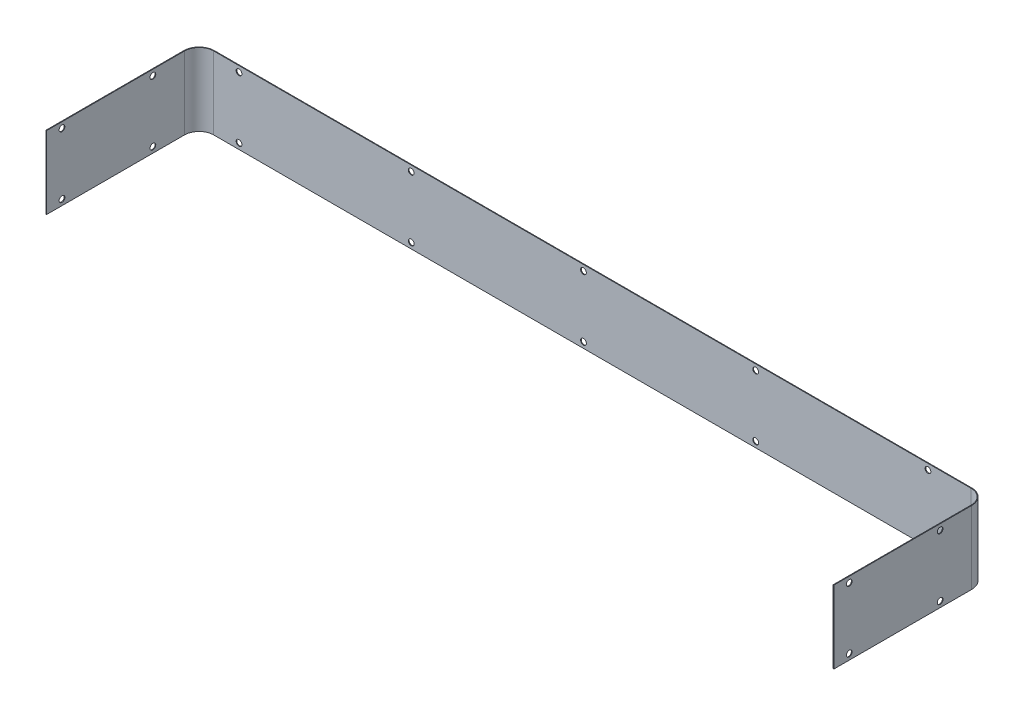
ISO-10303-21;
HEADER;
FILE_DESCRIPTION(('STEP AP214'),'2;1');
FILE_NAME('part.step','',(''),(''),'','','');
FILE_SCHEMA(('AUTOMOTIVE_DESIGN { 1 0 10303 214 1 1 1 1 }'));
ENDSEC;
DATA;
#1=APPLICATION_CONTEXT('core data for automotive mechanical design processes');
#2=APPLICATION_PROTOCOL_DEFINITION('international standard','automotive_design',2000,#1);
#3=PRODUCT_CONTEXT('',#1,'mechanical');
#4=PRODUCT('Part','Part','',(#3));
#5=PRODUCT_RELATED_PRODUCT_CATEGORY('part','',(#4));
#6=PRODUCT_DEFINITION_FORMATION('','',#4);
#7=PRODUCT_DEFINITION_CONTEXT('part definition',#1,'design');
#8=PRODUCT_DEFINITION('design','',#6,#7);
#9=PRODUCT_DEFINITION_SHAPE('','',#8);
#10=(LENGTH_UNIT() NAMED_UNIT(*) SI_UNIT(.MILLI.,.METRE.));
#11=(NAMED_UNIT(*) PLANE_ANGLE_UNIT() SI_UNIT($,.RADIAN.));
#12=(NAMED_UNIT(*) SI_UNIT($,.STERADIAN.) SOLID_ANGLE_UNIT());
#13=UNCERTAINTY_MEASURE_WITH_UNIT(LENGTH_MEASURE(1.E-05),#10,'distance_accuracy_value','');
#14=(GEOMETRIC_REPRESENTATION_CONTEXT(3) GLOBAL_UNCERTAINTY_ASSIGNED_CONTEXT((#13)) GLOBAL_UNIT_ASSIGNED_CONTEXT((#10,
#11,#12)) REPRESENTATION_CONTEXT('',''));
#15=CARTESIAN_POINT('',(0.,0.,0.));
#16=DIRECTION('',(0.,0.,1.));
#17=DIRECTION('',(1.,0.,0.));
#18=AXIS2_PLACEMENT_3D('',#15,#16,#17);
#19=CARTESIAN_POINT('',(16.,76.,-160.));
#20=DIRECTION('',(0.,1.,0.));
#21=DIRECTION('',(0.,0.,1.));
#22=AXIS2_PLACEMENT_3D('',#19,#20,#21);
#23=PLANE('',#22);
#24=DIRECTION('',(0.,0.,1.));
#25=VECTOR('',#24,1.);
#26=CARTESIAN_POINT('',(16.,76.,-160.));
#27=LINE('',#26,#25);
#28=CARTESIAN_POINT('',(16.,76.,-160.));
#29=VERTEX_POINT('',#28);
#30=CARTESIAN_POINT('',(16.,76.,-159.3));
#31=VERTEX_POINT('',#30);
#32=EDGE_CURVE('E11',#29,#31,#27,.T.);
#33=ORIENTED_EDGE('',*,*,#32,.F.);
#34=CARTESIAN_POINT('',(16.,76.,-144.));
#35=DIRECTION('',(0.,-1.,0.));
#36=DIRECTION('',(0.,0.,-1.));
#37=AXIS2_PLACEMENT_3D('',#34,#35,#36);
#38=CIRCLE('',#37,16.);
#39=CARTESIAN_POINT('',(0.,76.,-144.));
#40=VERTEX_POINT('',#39);
#41=EDGE_CURVE('E323',#40,#29,#38,.T.);
#42=ORIENTED_EDGE('',*,*,#41,.F.);
#43=DIRECTION('',(-1.,0.,0.));
#44=VECTOR('',#43,1.);
#45=CARTESIAN_POINT('',(0.70000000000002,76.,-144.));
#46=LINE('',#45,#44);
#47=CARTESIAN_POINT('',(0.70000000000002,76.,-144.));
#48=VERTEX_POINT('',#47);
#49=EDGE_CURVE('E47',#48,#40,#46,.T.);
#50=ORIENTED_EDGE('',*,*,#49,.F.);
#51=CARTESIAN_POINT('',(16.,76.,-144.));
#52=DIRECTION('',(0.,1.,0.));
#53=DIRECTION('',(1.,0.,0.));
#54=AXIS2_PLACEMENT_3D('',#51,#52,#53);
#55=CIRCLE('',#54,15.3);
#56=EDGE_CURVE('E149',#48,#31,#55,.F.);
#57=ORIENTED_EDGE('',*,*,#56,.T.);
#58=EDGE_LOOP('',(#33,#42,#50,#57));
#59=FACE_BOUND('',#58,.T.);
#60=ADVANCED_FACE('F38',(#59),#23,.T.);
#61=CARTESIAN_POINT('',(0.70000000000002,76.,-144.));
#62=DIRECTION('',(0.,1.,0.));
#63=DIRECTION('',(0.,0.,1.));
#64=AXIS2_PLACEMENT_3D('',#61,#62,#63);
#65=PLANE('',#64);
#66=DIRECTION('',(1.,0.,0.));
#67=VECTOR('',#66,1.);
#68=CARTESIAN_POINT('',(16.,76.,-160.));
#69=LINE('',#68,#67);
#70=CARTESIAN_POINT('',(807.4,76.,-160.));
#71=VERTEX_POINT('',#70);
#72=EDGE_CURVE('E143',#29,#71,#69,.T.);
#73=ORIENTED_EDGE('',*,*,#72,.F.);
#74=ORIENTED_EDGE('',*,*,#32,.T.);
#75=DIRECTION('',(1.,0.,0.));
#76=VECTOR('',#75,1.);
#77=CARTESIAN_POINT('',(16.,76.,-159.3));
#78=LINE('',#77,#76);
#79=CARTESIAN_POINT('',(807.4,76.,-159.3));
#80=VERTEX_POINT('',#79);
#81=EDGE_CURVE('E140',#31,#80,#78,.T.);
#82=ORIENTED_EDGE('',*,*,#81,.T.);
#83=DIRECTION('',(0.,0.,-1.));
#84=VECTOR('',#83,1.);
#85=CARTESIAN_POINT('',(807.4,76.,-159.3));
#86=LINE('',#85,#84);
#87=EDGE_CURVE('E232',#80,#71,#86,.T.);
#88=ORIENTED_EDGE('',*,*,#87,.T.);
#89=EDGE_LOOP('',(#73,#74,#82,#88));
#90=FACE_BOUND('',#89,.T.);
#91=ADVANCED_FACE('F138',(#90),#65,.T.);
#92=CARTESIAN_POINT('',(0.,0.,-144.));
#93=DIRECTION('',(0.,-1.,0.));
#94=DIRECTION('',(0.,0.,-1.));
#95=AXIS2_PLACEMENT_3D('',#92,#93,#94);
#96=PLANE('',#95);
#97=DIRECTION('',(1.,0.,0.));
#98=VECTOR('',#97,1.);
#99=CARTESIAN_POINT('',(0.,0.,-144.));
#100=LINE('',#99,#98);
#101=CARTESIAN_POINT('',(0.,0.,-144.));
#102=VERTEX_POINT('',#101);
#103=CARTESIAN_POINT('',(0.70000000000002,0.,-144.));
#104=VERTEX_POINT('',#103);
#105=EDGE_CURVE('E237',#102,#104,#100,.T.);
#106=ORIENTED_EDGE('',*,*,#105,.F.);
#107=CARTESIAN_POINT('',(16.,0.,-144.));
#108=DIRECTION('',(0.,-1.,0.));
#109=DIRECTION('',(0.,0.,-1.));
#110=AXIS2_PLACEMENT_3D('',#107,#108,#109);
#111=CIRCLE('',#110,16.);
#112=CARTESIAN_POINT('',(16.,0.,-160.));
#113=VERTEX_POINT('',#112);
#114=EDGE_CURVE('E189',#102,#113,#111,.T.);
#115=ORIENTED_EDGE('',*,*,#114,.T.);
#116=DIRECTION('',(0.,0.,-1.));
#117=VECTOR('',#116,1.);
#118=CARTESIAN_POINT('',(16.,0.,-159.3));
#119=LINE('',#118,#117);
#120=CARTESIAN_POINT('',(16.,0.,-159.3));
#121=VERTEX_POINT('',#120);
#122=EDGE_CURVE('E235',#121,#113,#119,.T.);
#123=ORIENTED_EDGE('',*,*,#122,.F.);
#124=CARTESIAN_POINT('',(16.,0.,-144.));
#125=DIRECTION('',(0.,1.,0.));
#126=DIRECTION('',(1.,0.,0.));
#127=AXIS2_PLACEMENT_3D('',#124,#125,#126);
#128=CIRCLE('',#127,15.3);
#129=EDGE_CURVE('E161',#104,#121,#128,.F.);
#130=ORIENTED_EDGE('',*,*,#129,.F.);
#131=EDGE_LOOP('',(#106,#115,#123,#130));
#132=FACE_BOUND('',#131,.T.);
#133=ADVANCED_FACE('F341',(#132),#96,.T.);
#134=CARTESIAN_POINT('',(16.,0.,-159.3));
#135=DIRECTION('',(0.,-1.,0.));
#136=DIRECTION('',(0.,0.,-1.));
#137=AXIS2_PLACEMENT_3D('',#134,#135,#136);
#138=PLANE('',#137);
#139=DIRECTION('',(0.,0.,-1.));
#140=VECTOR('',#139,1.);
#141=CARTESIAN_POINT('',(0.,0.,0.));
#142=LINE('',#141,#140);
#143=CARTESIAN_POINT('',(0.,0.,0.));
#144=VERTEX_POINT('',#143);
#145=EDGE_CURVE('E192',#144,#102,#142,.T.);
#146=ORIENTED_EDGE('',*,*,#145,.T.);
#147=ORIENTED_EDGE('',*,*,#105,.T.);
#148=DIRECTION('',(0.,0.,-1.));
#149=VECTOR('',#148,1.);
#150=CARTESIAN_POINT('',(0.7,0.,0.));
#151=LINE('',#150,#149);
#152=CARTESIAN_POINT('',(0.7,0.,0.));
#153=VERTEX_POINT('',#152);
#154=EDGE_CURVE('E198',#153,#104,#151,.T.);
#155=ORIENTED_EDGE('',*,*,#154,.F.);
#156=DIRECTION('',(-1.,0.,0.));
#157=VECTOR('',#156,1.);
#158=CARTESIAN_POINT('',(0.7,0.,0.));
#159=LINE('',#158,#157);
#160=EDGE_CURVE('E195',#153,#144,#159,.T.);
#161=ORIENTED_EDGE('',*,*,#160,.T.);
#162=EDGE_LOOP('',(#146,#147,#155,#161));
#163=FACE_BOUND('',#162,.T.);
#164=ADVANCED_FACE('F388',(#163),#138,.T.);
#165=CARTESIAN_POINT('',(823.4,76.,-144.));
#166=DIRECTION('',(0.,1.,0.));
#167=DIRECTION('',(0.,0.,1.));
#168=AXIS2_PLACEMENT_3D('',#165,#166,#167);
#169=PLANE('',#168);
#170=DIRECTION('',(-1.,0.,0.));
#171=VECTOR('',#170,1.);
#172=CARTESIAN_POINT('',(823.4,76.,-144.));
#173=LINE('',#172,#171);
#174=CARTESIAN_POINT('',(823.4,76.,-144.));
#175=VERTEX_POINT('',#174);
#176=CARTESIAN_POINT('',(822.7,76.,-144.));
#177=VERTEX_POINT('',#176);
#178=EDGE_CURVE('E56',#175,#177,#173,.T.);
#179=ORIENTED_EDGE('',*,*,#178,.F.);
#180=CARTESIAN_POINT('',(807.4,76.,-144.));
#181=DIRECTION('',(0.,-1.,0.));
#182=DIRECTION('',(0.,0.,-1.));
#183=AXIS2_PLACEMENT_3D('',#180,#181,#182);
#184=CIRCLE('',#183,16.);
#185=EDGE_CURVE('E319',#71,#175,#184,.T.);
#186=ORIENTED_EDGE('',*,*,#185,.F.);
#187=ORIENTED_EDGE('',*,*,#87,.F.);
#188=CARTESIAN_POINT('',(807.4,76.,-144.));
#189=DIRECTION('',(0.,1.,0.));
#190=DIRECTION('',(1.,0.,0.));
#191=AXIS2_PLACEMENT_3D('',#188,#189,#190);
#192=CIRCLE('',#191,15.3);
#193=EDGE_CURVE('E169',#80,#177,#192,.F.);
#194=ORIENTED_EDGE('',*,*,#193,.T.);
#195=EDGE_LOOP('',(#179,#186,#187,#194));
#196=FACE_BOUND('',#195,.T.);
#197=ADVANCED_FACE('F393',(#196),#169,.T.);
#198=CARTESIAN_POINT('',(807.4,76.,-159.3));
#199=DIRECTION('',(0.,1.,0.));
#200=DIRECTION('',(0.,0.,1.));
#201=AXIS2_PLACEMENT_3D('',#198,#199,#200);
#202=PLANE('',#201);
#203=DIRECTION('',(0.,0.,1.));
#204=VECTOR('',#203,1.);
#205=CARTESIAN_POINT('',(823.4,76.,-144.));
#206=LINE('',#205,#204);
#207=CARTESIAN_POINT('',(823.4,76.,0.));
#208=VERTEX_POINT('',#207);
#209=EDGE_CURVE('E316',#175,#208,#206,.T.);
#210=ORIENTED_EDGE('',*,*,#209,.F.);
#211=ORIENTED_EDGE('',*,*,#178,.T.);
#212=DIRECTION('',(0.,0.,-1.));
#213=VECTOR('',#212,1.);
#214=CARTESIAN_POINT('',(822.7,76.,-144.));
#215=LINE('',#214,#213);
#216=CARTESIAN_POINT('',(822.7,76.,0.));
#217=VERTEX_POINT('',#216);
#218=EDGE_CURVE('E110',#177,#217,#215,.F.);
#219=ORIENTED_EDGE('',*,*,#218,.T.);
#220=DIRECTION('',(-1.,0.,0.));
#221=VECTOR('',#220,1.);
#222=CARTESIAN_POINT('',(823.4,76.,0.));
#223=LINE('',#222,#221);
#224=EDGE_CURVE('E313',#208,#217,#223,.T.);
#225=ORIENTED_EDGE('',*,*,#224,.F.);
#226=EDGE_LOOP('',(#210,#211,#219,#225));
#227=FACE_BOUND('',#226,.T.);
#228=ADVANCED_FACE('F368',(#227),#202,.T.);
#229=CARTESIAN_POINT('',(807.4,0.,-160.));
#230=DIRECTION('',(0.,-1.,0.));
#231=DIRECTION('',(0.,0.,-1.));
#232=AXIS2_PLACEMENT_3D('',#229,#230,#231);
#233=PLANE('',#232);
#234=DIRECTION('',(0.,0.,1.));
#235=VECTOR('',#234,1.);
#236=CARTESIAN_POINT('',(807.4,0.,-160.));
#237=LINE('',#236,#235);
#238=CARTESIAN_POINT('',(807.4,0.,-160.));
#239=VERTEX_POINT('',#238);
#240=CARTESIAN_POINT('',(807.4,0.,-159.3));
#241=VERTEX_POINT('',#240);
#242=EDGE_CURVE('E97',#239,#241,#237,.T.);
#243=ORIENTED_EDGE('',*,*,#242,.F.);
#244=CARTESIAN_POINT('',(807.4,0.,-144.));
#245=DIRECTION('',(0.,-1.,0.));
#246=DIRECTION('',(0.,0.,-1.));
#247=AXIS2_PLACEMENT_3D('',#244,#245,#246);
#248=CIRCLE('',#247,16.);
#249=CARTESIAN_POINT('',(823.4,0.,-144.));
#250=VERTEX_POINT('',#249);
#251=EDGE_CURVE('E185',#239,#250,#248,.T.);
#252=ORIENTED_EDGE('',*,*,#251,.T.);
#253=DIRECTION('',(1.,0.,0.));
#254=VECTOR('',#253,1.);
#255=CARTESIAN_POINT('',(822.7,0.,-144.));
#256=LINE('',#255,#254);
#257=CARTESIAN_POINT('',(822.7,0.,-144.));
#258=VERTEX_POINT('',#257);
#259=EDGE_CURVE('E104',#258,#250,#256,.T.);
#260=ORIENTED_EDGE('',*,*,#259,.F.);
#261=CARTESIAN_POINT('',(807.4,0.,-144.));
#262=DIRECTION('',(0.,1.,0.));
#263=DIRECTION('',(1.,0.,0.));
#264=AXIS2_PLACEMENT_3D('',#261,#262,#263);
#265=CIRCLE('',#264,15.3);
#266=EDGE_CURVE('E204',#241,#258,#265,.F.);
#267=ORIENTED_EDGE('',*,*,#266,.F.);
#268=EDGE_LOOP('',(#243,#252,#260,#267));
#269=FACE_BOUND('',#268,.T.);
#270=ADVANCED_FACE('F356',(#269),#233,.T.);
#271=CARTESIAN_POINT('',(822.7,0.,-144.));
#272=DIRECTION('',(0.,-1.,0.));
#273=DIRECTION('',(0.,0.,-1.));
#274=AXIS2_PLACEMENT_3D('',#271,#272,#273);
#275=PLANE('',#274);
#276=DIRECTION('',(1.,0.,0.));
#277=VECTOR('',#276,1.);
#278=CARTESIAN_POINT('',(16.,0.,-160.));
#279=LINE('',#278,#277);
#280=EDGE_CURVE('E187',#113,#239,#279,.T.);
#281=ORIENTED_EDGE('',*,*,#280,.T.);
#282=ORIENTED_EDGE('',*,*,#242,.T.);
#283=DIRECTION('',(1.,0.,0.));
#284=VECTOR('',#283,1.);
#285=CARTESIAN_POINT('',(16.,0.,-159.3));
#286=LINE('',#285,#284);
#287=EDGE_CURVE('E202',#121,#241,#286,.T.);
#288=ORIENTED_EDGE('',*,*,#287,.F.);
#289=ORIENTED_EDGE('',*,*,#122,.T.);
#290=EDGE_LOOP('',(#281,#282,#288,#289));
#291=FACE_BOUND('',#290,.T.);
#292=ADVANCED_FACE('F343',(#291),#275,.T.);
#293=CARTESIAN_POINT('',(822.7,76.,-144.));
#294=DIRECTION('',(1.,0.,0.));
#295=DIRECTION('',(0.,0.,-1.));
#296=AXIS2_PLACEMENT_3D('',#293,#294,#295);
#297=PLANE('',#296);
#298=CARTESIAN_POINT('',(822.7,6.00000000000003,-16.));
#299=DIRECTION('',(1.,0.,0.));
#300=DIRECTION('',(0.,0.,-1.));
#301=AXIS2_PLACEMENT_3D('',#298,#299,#300);
#302=CIRCLE('',#301,3.);
#303=CARTESIAN_POINT('',(822.7,6.00000000000003,-19.));
#304=VERTEX_POINT('',#303);
#305=EDGE_CURVE('E179',#304,#304,#302,.T.);
#306=ORIENTED_EDGE('',*,*,#305,.T.);
#307=EDGE_LOOP('',(#306));
#308=FACE_BOUND('',#307,.T.);
#309=CARTESIAN_POINT('',(822.7,6.00000000000001,-111.));
#310=DIRECTION('',(1.,0.,0.));
#311=DIRECTION('',(0.,0.,-1.));
#312=AXIS2_PLACEMENT_3D('',#309,#310,#311);
#313=CIRCLE('',#312,3.00000000000001);
#314=CARTESIAN_POINT('',(822.7,6.00000000000001,-114.));
#315=VERTEX_POINT('',#314);
#316=EDGE_CURVE('E252',#315,#315,#313,.T.);
#317=ORIENTED_EDGE('',*,*,#316,.T.);
#318=EDGE_LOOP('',(#317));
#319=FACE_BOUND('',#318,.T.);
#320=CARTESIAN_POINT('',(822.7,70.,-111.));
#321=DIRECTION('',(1.,0.,0.));
#322=DIRECTION('',(0.,0.,-1.));
#323=AXIS2_PLACEMENT_3D('',#320,#321,#322);
#324=CIRCLE('',#323,3.00000000000001);
#325=CARTESIAN_POINT('',(822.7,70.,-114.));
#326=VERTEX_POINT('',#325);
#327=EDGE_CURVE('E248',#326,#326,#324,.T.);
#328=ORIENTED_EDGE('',*,*,#327,.T.);
#329=EDGE_LOOP('',(#328));
#330=FACE_BOUND('',#329,.T.);
#331=CARTESIAN_POINT('',(822.7,70.,-16.));
#332=DIRECTION('',(1.,0.,0.));
#333=DIRECTION('',(0.,0.,-1.));
#334=AXIS2_PLACEMENT_3D('',#331,#332,#333);
#335=CIRCLE('',#334,3.);
#336=CARTESIAN_POINT('',(822.7,70.,-19.));
#337=VERTEX_POINT('',#336);
#338=EDGE_CURVE('E243',#337,#337,#335,.T.);
#339=ORIENTED_EDGE('',*,*,#338,.T.);
#340=EDGE_LOOP('',(#339));
#341=FACE_BOUND('',#340,.T.);
#342=DIRECTION('',(0.,0.,-1.));
#343=VECTOR('',#342,1.);
#344=CARTESIAN_POINT('',(822.7,0.,-144.));
#345=LINE('',#344,#343);
#346=CARTESIAN_POINT('',(822.7,0.,0.));
#347=VERTEX_POINT('',#346);
#348=EDGE_CURVE('E175',#258,#347,#345,.F.);
#349=ORIENTED_EDGE('',*,*,#348,.T.);
#350=DIRECTION('',(0.,-1.,0.));
#351=VECTOR('',#350,1.);
#352=CARTESIAN_POINT('',(822.7,76.,0.));
#353=LINE('',#352,#351);
#354=EDGE_CURVE('E228',#217,#347,#353,.T.);
#355=ORIENTED_EDGE('',*,*,#354,.F.);
#356=ORIENTED_EDGE('',*,*,#218,.F.);
#357=DIRECTION('',(0.,-1.,0.));
#358=VECTOR('',#357,1.);
#359=CARTESIAN_POINT('',(822.7,76.,-144.));
#360=LINE('',#359,#358);
#361=EDGE_CURVE('E171',#177,#258,#360,.T.);
#362=ORIENTED_EDGE('',*,*,#361,.T.);
#363=EDGE_LOOP('',(#349,#355,#356,#362));
#364=FACE_BOUND('',#363,.T.);
#365=ADVANCED_FACE('F362',(#308,#319,#330,#341,#364),#297,.F.);
#366=CARTESIAN_POINT('',(823.4,76.,0.));
#367=DIRECTION('',(0.,0.,1.));
#368=DIRECTION('',(1.,0.,0.));
#369=AXIS2_PLACEMENT_3D('',#366,#367,#368);
#370=PLANE('',#369);
#371=DIRECTION('',(-1.,0.,0.));
#372=VECTOR('',#371,1.);
#373=CARTESIAN_POINT('',(823.4,0.,0.));
#374=LINE('',#373,#372);
#375=CARTESIAN_POINT('',(823.4,0.,0.));
#376=VERTEX_POINT('',#375);
#377=EDGE_CURVE('E178',#376,#347,#374,.T.);
#378=ORIENTED_EDGE('',*,*,#377,.F.);
#379=DIRECTION('',(0.,-1.,0.));
#380=VECTOR('',#379,1.);
#381=CARTESIAN_POINT('',(823.4,76.,0.));
#382=LINE('',#381,#380);
#383=EDGE_CURVE('E226',#208,#376,#382,.T.);
#384=ORIENTED_EDGE('',*,*,#383,.F.);
#385=ORIENTED_EDGE('',*,*,#224,.T.);
#386=ORIENTED_EDGE('',*,*,#354,.T.);
#387=EDGE_LOOP('',(#378,#384,#385,#386));
#388=FACE_BOUND('',#387,.T.);
#389=ADVANCED_FACE('F367',(#388),#370,.T.);
#390=CARTESIAN_POINT('',(823.4,76.,-144.));
#391=DIRECTION('',(1.,0.,0.));
#392=DIRECTION('',(0.,0.,-1.));
#393=AXIS2_PLACEMENT_3D('',#390,#391,#392);
#394=PLANE('',#393);
#395=CARTESIAN_POINT('',(823.4,6.00000000000003,-16.));
#396=DIRECTION('',(1.,0.,0.));
#397=DIRECTION('',(0.,0.,1.));
#398=AXIS2_PLACEMENT_3D('',#395,#396,#397);
#399=CIRCLE('',#398,3.);
#400=CARTESIAN_POINT('',(823.4,6.00000000000003,-13.));
#401=VERTEX_POINT('',#400);
#402=EDGE_CURVE('E285',#401,#401,#399,.T.);
#403=ORIENTED_EDGE('',*,*,#402,.F.);
#404=EDGE_LOOP('',(#403));
#405=FACE_BOUND('',#404,.T.);
#406=CARTESIAN_POINT('',(823.4,6.00000000000001,-111.));
#407=DIRECTION('',(1.,0.,0.));
#408=DIRECTION('',(0.,0.,1.));
#409=AXIS2_PLACEMENT_3D('',#406,#407,#408);
#410=CIRCLE('',#409,3.00000000000001);
#411=CARTESIAN_POINT('',(823.4,6.00000000000001,-108.));
#412=VERTEX_POINT('',#411);
#413=EDGE_CURVE('E294',#412,#412,#410,.T.);
#414=ORIENTED_EDGE('',*,*,#413,.F.);
#415=EDGE_LOOP('',(#414));
#416=FACE_BOUND('',#415,.T.);
#417=CARTESIAN_POINT('',(823.4,70.,-111.));
#418=DIRECTION('',(1.,0.,0.));
#419=DIRECTION('',(0.,0.,-1.));
#420=AXIS2_PLACEMENT_3D('',#417,#418,#419);
#421=CIRCLE('',#420,3.00000000000001);
#422=CARTESIAN_POINT('',(823.4,70.,-114.));
#423=VERTEX_POINT('',#422);
#424=EDGE_CURVE('E517',#423,#423,#421,.T.);
#425=ORIENTED_EDGE('',*,*,#424,.F.);
#426=EDGE_LOOP('',(#425));
#427=FACE_BOUND('',#426,.T.);
#428=CARTESIAN_POINT('',(823.4,70.,-16.));
#429=DIRECTION('',(1.,0.,0.));
#430=DIRECTION('',(0.,0.,-1.));
#431=AXIS2_PLACEMENT_3D('',#428,#429,#430);
#432=CIRCLE('',#431,3.);
#433=CARTESIAN_POINT('',(823.4,70.,-19.));
#434=VERTEX_POINT('',#433);
#435=EDGE_CURVE('E300',#434,#434,#432,.T.);
#436=ORIENTED_EDGE('',*,*,#435,.F.);
#437=EDGE_LOOP('',(#436));
#438=FACE_BOUND('',#437,.T.);
#439=DIRECTION('',(0.,0.,1.));
#440=VECTOR('',#439,1.);
#441=CARTESIAN_POINT('',(823.4,0.,-144.));
#442=LINE('',#441,#440);
#443=EDGE_CURVE('E182',#250,#376,#442,.T.);
#444=ORIENTED_EDGE('',*,*,#443,.F.);
#445=DIRECTION('',(0.,-1.,0.));
#446=VECTOR('',#445,1.);
#447=CARTESIAN_POINT('',(823.4,76.,-144.));
#448=LINE('',#447,#446);
#449=EDGE_CURVE('E223',#175,#250,#448,.T.);
#450=ORIENTED_EDGE('',*,*,#449,.F.);
#451=ORIENTED_EDGE('',*,*,#209,.T.);
#452=ORIENTED_EDGE('',*,*,#383,.T.);
#453=EDGE_LOOP('',(#444,#450,#451,#452));
#454=FACE_BOUND('',#453,.T.);
#455=ADVANCED_FACE('F370',(#405,#416,#427,#438,#454),#394,.T.);
#456=CARTESIAN_POINT('',(807.4,76.,-144.));
#457=DIRECTION('',(0.,-1.,0.));
#458=DIRECTION('',(0.,0.,-1.));
#459=AXIS2_PLACEMENT_3D('',#456,#457,#458);
#460=CYLINDRICAL_SURFACE('',#459,16.);
#461=ORIENTED_EDGE('',*,*,#251,.F.);
#462=DIRECTION('',(0.,-1.,0.));
#463=VECTOR('',#462,1.);
#464=CARTESIAN_POINT('',(807.4,76.,-160.));
#465=LINE('',#464,#463);
#466=EDGE_CURVE('E220',#71,#239,#465,.T.);
#467=ORIENTED_EDGE('',*,*,#466,.F.);
#468=ORIENTED_EDGE('',*,*,#185,.T.);
#469=ORIENTED_EDGE('',*,*,#449,.T.);
#470=EDGE_LOOP('',(#461,#467,#468,#469));
#471=FACE_BOUND('',#470,.T.);
#472=ADVANCED_FACE('F353',(#471),#460,.T.);
#473=CARTESIAN_POINT('',(16.,76.,-160.));
#474=DIRECTION('',(0.,0.,-1.));
#475=DIRECTION('',(-1.,0.,0.));
#476=AXIS2_PLACEMENT_3D('',#473,#474,#475);
#477=PLANE('',#476);
#478=CARTESIAN_POINT('',(42.4000000000007,70.,-160.));
#479=DIRECTION('',(0.,0.,-1.));
#480=DIRECTION('',(-1.,0.,0.));
#481=AXIS2_PLACEMENT_3D('',#478,#479,#480);
#482=CIRCLE('',#481,2.99999999999994);
#483=CARTESIAN_POINT('',(39.4000000000007,70.,-160.));
#484=VERTEX_POINT('',#483);
#485=EDGE_CURVE('E475',#484,#484,#482,.T.);
#486=ORIENTED_EDGE('',*,*,#485,.F.);
#487=EDGE_LOOP('',(#486));
#488=FACE_BOUND('',#487,.T.);
#489=CARTESIAN_POINT('',(582.4,70.,-160.));
#490=DIRECTION('',(0.,0.,-1.));
#491=DIRECTION('',(-1.,0.,0.));
#492=AXIS2_PLACEMENT_3D('',#489,#490,#491);
#493=CIRCLE('',#492,2.99999999999993);
#494=CARTESIAN_POINT('',(579.4,70.,-160.));
#495=VERTEX_POINT('',#494);
#496=EDGE_CURVE('E479',#495,#495,#493,.T.);
#497=ORIENTED_EDGE('',*,*,#496,.F.);
#498=EDGE_LOOP('',(#497));
#499=FACE_BOUND('',#498,.T.);
#500=CARTESIAN_POINT('',(402.4,70.,-160.));
#501=DIRECTION('',(0.,0.,-1.));
#502=DIRECTION('',(-1.,0.,0.));
#503=AXIS2_PLACEMENT_3D('',#500,#501,#502);
#504=CIRCLE('',#503,2.99999999999994);
#505=CARTESIAN_POINT('',(399.4,70.,-160.));
#506=VERTEX_POINT('',#505);
#507=EDGE_CURVE('E483',#506,#506,#504,.T.);
#508=ORIENTED_EDGE('',*,*,#507,.F.);
#509=EDGE_LOOP('',(#508));
#510=FACE_BOUND('',#509,.T.);
#511=CARTESIAN_POINT('',(222.4,70.,-160.));
#512=DIRECTION('',(0.,0.,-1.));
#513=DIRECTION('',(-1.,0.,0.));
#514=AXIS2_PLACEMENT_3D('',#511,#512,#513);
#515=CIRCLE('',#514,2.99999999999994);
#516=CARTESIAN_POINT('',(219.400000000001,70.,-160.));
#517=VERTEX_POINT('',#516);
#518=EDGE_CURVE('E487',#517,#517,#515,.T.);
#519=ORIENTED_EDGE('',*,*,#518,.F.);
#520=EDGE_LOOP('',(#519));
#521=FACE_BOUND('',#520,.T.);
#522=CARTESIAN_POINT('',(42.4000000000007,6.00000000000028,-160.));
#523=DIRECTION('',(0.,0.,-1.));
#524=DIRECTION('',(1.,0.,0.));
#525=AXIS2_PLACEMENT_3D('',#522,#523,#524);
#526=CIRCLE('',#525,2.99999999999994);
#527=CARTESIAN_POINT('',(45.4000000000006,6.00000000000028,-160.));
#528=VERTEX_POINT('',#527);
#529=EDGE_CURVE('E491',#528,#528,#526,.T.);
#530=ORIENTED_EDGE('',*,*,#529,.F.);
#531=EDGE_LOOP('',(#530));
#532=FACE_BOUND('',#531,.T.);
#533=CARTESIAN_POINT('',(222.4,6.00000000000023,-160.));
#534=DIRECTION('',(0.,0.,-1.));
#535=DIRECTION('',(1.,0.,0.));
#536=AXIS2_PLACEMENT_3D('',#533,#534,#535);
#537=CIRCLE('',#536,2.99999999999994);
#538=CARTESIAN_POINT('',(225.4,6.00000000000023,-160.));
#539=VERTEX_POINT('',#538);
#540=EDGE_CURVE('E495',#539,#539,#537,.T.);
#541=ORIENTED_EDGE('',*,*,#540,.F.);
#542=EDGE_LOOP('',(#541));
#543=FACE_BOUND('',#542,.T.);
#544=CARTESIAN_POINT('',(402.4,6.00000000000016,-160.));
#545=DIRECTION('',(0.,0.,-1.));
#546=DIRECTION('',(1.,0.,0.));
#547=AXIS2_PLACEMENT_3D('',#544,#545,#546);
#548=CIRCLE('',#547,2.99999999999994);
#549=CARTESIAN_POINT('',(405.4,6.00000000000016,-160.));
#550=VERTEX_POINT('',#549);
#551=EDGE_CURVE('E499',#550,#550,#548,.T.);
#552=ORIENTED_EDGE('',*,*,#551,.F.);
#553=EDGE_LOOP('',(#552));
#554=FACE_BOUND('',#553,.T.);
#555=CARTESIAN_POINT('',(582.4,6.00000000000009,-160.));
#556=DIRECTION('',(0.,0.,-1.));
#557=DIRECTION('',(1.,0.,0.));
#558=AXIS2_PLACEMENT_3D('',#555,#556,#557);
#559=CIRCLE('',#558,2.99999999999993);
#560=CARTESIAN_POINT('',(585.4,6.00000000000009,-160.));
#561=VERTEX_POINT('',#560);
#562=EDGE_CURVE('E503',#561,#561,#559,.T.);
#563=ORIENTED_EDGE('',*,*,#562,.F.);
#564=EDGE_LOOP('',(#563));
#565=FACE_BOUND('',#564,.T.);
#566=CARTESIAN_POINT('',(762.4,6.00000000000002,-160.));
#567=DIRECTION('',(0.,0.,-1.));
#568=DIRECTION('',(1.,0.,0.));
#569=AXIS2_PLACEMENT_3D('',#566,#567,#568);
#570=CIRCLE('',#569,2.99999999999993);
#571=CARTESIAN_POINT('',(765.4,6.00000000000002,-160.));
#572=VERTEX_POINT('',#571);
#573=EDGE_CURVE('E507',#572,#572,#570,.T.);
#574=ORIENTED_EDGE('',*,*,#573,.F.);
#575=EDGE_LOOP('',(#574));
#576=FACE_BOUND('',#575,.T.);
#577=CARTESIAN_POINT('',(762.4,70.,-160.));
#578=DIRECTION('',(0.,0.,-1.));
#579=DIRECTION('',(-1.,0.,0.));
#580=AXIS2_PLACEMENT_3D('',#577,#578,#579);
#581=CIRCLE('',#580,2.99999999999993);
#582=CARTESIAN_POINT('',(759.4,70.,-160.));
#583=VERTEX_POINT('',#582);
#584=EDGE_CURVE('E260',#583,#583,#581,.T.);
#585=ORIENTED_EDGE('',*,*,#584,.F.);
#586=EDGE_LOOP('',(#585));
#587=FACE_BOUND('',#586,.T.);
#588=ORIENTED_EDGE('',*,*,#280,.F.);
#589=DIRECTION('',(0.,-1.,0.));
#590=VECTOR('',#589,1.);
#591=CARTESIAN_POINT('',(16.,76.,-160.));
#592=LINE('',#591,#590);
#593=EDGE_CURVE('E217',#29,#113,#592,.T.);
#594=ORIENTED_EDGE('',*,*,#593,.F.);
#595=ORIENTED_EDGE('',*,*,#72,.T.);
#596=ORIENTED_EDGE('',*,*,#466,.T.);
#597=EDGE_LOOP('',(#588,#594,#595,#596));
#598=FACE_BOUND('',#597,.T.);
#599=ADVANCED_FACE('F348',(#488,#499,#510,#521,#532,#543,#554,#565,#576,#587,#598),#477,.T.);
#600=CARTESIAN_POINT('',(16.,76.,-144.));
#601=DIRECTION('',(0.,-1.,0.));
#602=DIRECTION('',(0.,0.,-1.));
#603=AXIS2_PLACEMENT_3D('',#600,#601,#602);
#604=CYLINDRICAL_SURFACE('',#603,16.);
#605=ORIENTED_EDGE('',*,*,#114,.F.);
#606=DIRECTION('',(0.,-1.,0.));
#607=VECTOR('',#606,1.);
#608=CARTESIAN_POINT('',(0.,76.,-144.));
#609=LINE('',#608,#607);
#610=EDGE_CURVE('E214',#40,#102,#609,.T.);
#611=ORIENTED_EDGE('',*,*,#610,.F.);
#612=ORIENTED_EDGE('',*,*,#41,.T.);
#613=ORIENTED_EDGE('',*,*,#593,.T.);
#614=EDGE_LOOP('',(#605,#611,#612,#613));
#615=FACE_BOUND('',#614,.T.);
#616=ADVANCED_FACE('F346',(#615),#604,.T.);
#617=CARTESIAN_POINT('',(0.,76.,0.));
#618=DIRECTION('',(-1.,0.,0.));
#619=DIRECTION('',(0.,0.,1.));
#620=AXIS2_PLACEMENT_3D('',#617,#618,#619);
#621=PLANE('',#620);
#622=CARTESIAN_POINT('',(0.,6.00000000000003,-16.));
#623=DIRECTION('',(1.,0.,0.));
#624=DIRECTION('',(0.,0.,1.));
#625=AXIS2_PLACEMENT_3D('',#622,#623,#624);
#626=CIRCLE('',#625,3.);
#627=CARTESIAN_POINT('',(0.,6.00000000000003,-13.));
#628=VERTEX_POINT('',#627);
#629=EDGE_CURVE('E289',#628,#628,#626,.T.);
#630=ORIENTED_EDGE('',*,*,#629,.T.);
#631=EDGE_LOOP('',(#630));
#632=FACE_BOUND('',#631,.T.);
#633=CARTESIAN_POINT('',(0.,6.00000000000001,-111.));
#634=DIRECTION('',(1.,0.,0.));
#635=DIRECTION('',(0.,0.,1.));
#636=AXIS2_PLACEMENT_3D('',#633,#634,#635);
#637=CIRCLE('',#636,3.00000000000001);
#638=CARTESIAN_POINT('',(0.,6.00000000000001,-108.));
#639=VERTEX_POINT('',#638);
#640=EDGE_CURVE('E520',#639,#639,#637,.T.);
#641=ORIENTED_EDGE('',*,*,#640,.T.);
#642=EDGE_LOOP('',(#641));
#643=FACE_BOUND('',#642,.T.);
#644=CARTESIAN_POINT('',(0.,70.,-111.));
#645=DIRECTION('',(1.,0.,0.));
#646=DIRECTION('',(0.,0.,-1.));
#647=AXIS2_PLACEMENT_3D('',#644,#645,#646);
#648=CIRCLE('',#647,3.00000000000001);
#649=CARTESIAN_POINT('',(0.,70.,-114.));
#650=VERTEX_POINT('',#649);
#651=EDGE_CURVE('E303',#650,#650,#648,.T.);
#652=ORIENTED_EDGE('',*,*,#651,.T.);
#653=EDGE_LOOP('',(#652));
#654=FACE_BOUND('',#653,.T.);
#655=CARTESIAN_POINT('',(0.,70.,-16.));
#656=DIRECTION('',(1.,0.,0.));
#657=DIRECTION('',(0.,0.,-1.));
#658=AXIS2_PLACEMENT_3D('',#655,#656,#657);
#659=CIRCLE('',#658,3.);
#660=CARTESIAN_POINT('',(0.,70.,-19.));
#661=VERTEX_POINT('',#660);
#662=EDGE_CURVE('E244',#661,#661,#659,.T.);
#663=ORIENTED_EDGE('',*,*,#662,.T.);
#664=EDGE_LOOP('',(#663));
#665=FACE_BOUND('',#664,.T.);
#666=ORIENTED_EDGE('',*,*,#145,.F.);
#667=DIRECTION('',(0.,-1.,0.));
#668=VECTOR('',#667,1.);
#669=CARTESIAN_POINT('',(0.,76.,0.));
#670=LINE('',#669,#668);
#671=CARTESIAN_POINT('',(0.,76.,0.));
#672=VERTEX_POINT('',#671);
#673=EDGE_CURVE('E212',#672,#144,#670,.T.);
#674=ORIENTED_EDGE('',*,*,#673,.F.);
#675=DIRECTION('',(0.,0.,-1.));
#676=VECTOR('',#675,1.);
#677=CARTESIAN_POINT('',(0.,76.,0.));
#678=LINE('',#677,#676);
#679=EDGE_CURVE('E325',#672,#40,#678,.T.);
#680=ORIENTED_EDGE('',*,*,#679,.T.);
#681=ORIENTED_EDGE('',*,*,#610,.T.);
#682=EDGE_LOOP('',(#666,#674,#680,#681));
#683=FACE_BOUND('',#682,.T.);
#684=ADVANCED_FACE('F457',(#632,#643,#654,#665,#683),#621,.T.);
#685=CARTESIAN_POINT('',(0.7,76.,0.));
#686=DIRECTION('',(0.,0.,1.));
#687=DIRECTION('',(1.,0.,0.));
#688=AXIS2_PLACEMENT_3D('',#685,#686,#687);
#689=PLANE('',#688);
#690=ORIENTED_EDGE('',*,*,#160,.F.);
#691=DIRECTION('',(0.,-1.,0.));
#692=VECTOR('',#691,1.);
#693=CARTESIAN_POINT('',(0.7,76.,0.));
#694=LINE('',#693,#692);
#695=CARTESIAN_POINT('',(0.7,76.,0.));
#696=VERTEX_POINT('',#695);
#697=EDGE_CURVE('E210',#696,#153,#694,.T.);
#698=ORIENTED_EDGE('',*,*,#697,.F.);
#699=DIRECTION('',(-1.,0.,0.));
#700=VECTOR('',#699,1.);
#701=CARTESIAN_POINT('',(0.7,76.,0.));
#702=LINE('',#701,#700);
#703=EDGE_CURVE('E328',#696,#672,#702,.T.);
#704=ORIENTED_EDGE('',*,*,#703,.T.);
#705=ORIENTED_EDGE('',*,*,#673,.T.);
#706=EDGE_LOOP('',(#690,#698,#704,#705));
#707=FACE_BOUND('',#706,.T.);
#708=ADVANCED_FACE('F449',(#707),#689,.T.);
#709=CARTESIAN_POINT('',(0.7,76.,0.));
#710=DIRECTION('',(-1.,0.,0.));
#711=DIRECTION('',(0.,0.,1.));
#712=AXIS2_PLACEMENT_3D('',#709,#710,#711);
#713=PLANE('',#712);
#714=CARTESIAN_POINT('',(0.7,6.00000000000003,-16.));
#715=DIRECTION('',(-1.,0.,0.));
#716=DIRECTION('',(0.,0.,1.));
#717=AXIS2_PLACEMENT_3D('',#714,#715,#716);
#718=CIRCLE('',#717,3.);
#719=CARTESIAN_POINT('',(0.7,6.00000000000003,-13.));
#720=VERTEX_POINT('',#719);
#721=EDGE_CURVE('E253',#720,#720,#718,.T.);
#722=ORIENTED_EDGE('',*,*,#721,.T.);
#723=EDGE_LOOP('',(#722));
#724=FACE_BOUND('',#723,.T.);
#725=CARTESIAN_POINT('',(0.7,6.00000000000001,-111.));
#726=DIRECTION('',(-1.,0.,0.));
#727=DIRECTION('',(0.,0.,1.));
#728=AXIS2_PLACEMENT_3D('',#725,#726,#727);
#729=CIRCLE('',#728,3.00000000000001);
#730=CARTESIAN_POINT('',(0.7,6.00000000000001,-108.));
#731=VERTEX_POINT('',#730);
#732=EDGE_CURVE('E249',#731,#731,#729,.T.);
#733=ORIENTED_EDGE('',*,*,#732,.T.);
#734=EDGE_LOOP('',(#733));
#735=FACE_BOUND('',#734,.T.);
#736=CARTESIAN_POINT('',(0.7,70.,-111.));
#737=DIRECTION('',(-1.,0.,0.));
#738=DIRECTION('',(0.,0.,1.));
#739=AXIS2_PLACEMENT_3D('',#736,#737,#738);
#740=CIRCLE('',#739,3.00000000000001);
#741=CARTESIAN_POINT('',(0.7,70.,-108.));
#742=VERTEX_POINT('',#741);
#743=EDGE_CURVE('E245',#742,#742,#740,.T.);
#744=ORIENTED_EDGE('',*,*,#743,.T.);
#745=EDGE_LOOP('',(#744));
#746=FACE_BOUND('',#745,.T.);
#747=CARTESIAN_POINT('',(0.7,70.,-16.));
#748=DIRECTION('',(-1.,0.,0.));
#749=DIRECTION('',(0.,0.,1.));
#750=AXIS2_PLACEMENT_3D('',#747,#748,#749);
#751=CIRCLE('',#750,3.);
#752=CARTESIAN_POINT('',(0.7,70.,-13.));
#753=VERTEX_POINT('',#752);
#754=EDGE_CURVE('E240',#753,#753,#751,.T.);
#755=ORIENTED_EDGE('',*,*,#754,.T.);
#756=EDGE_LOOP('',(#755));
#757=FACE_BOUND('',#756,.T.);
#758=ORIENTED_EDGE('',*,*,#154,.T.);
#759=DIRECTION('',(0.,-1.,0.));
#760=VECTOR('',#759,1.);
#761=CARTESIAN_POINT('',(0.70000000000002,76.,-144.));
#762=LINE('',#761,#760);
#763=EDGE_CURVE('E163',#48,#104,#762,.T.);
#764=ORIENTED_EDGE('',*,*,#763,.F.);
#765=DIRECTION('',(0.,0.,-1.));
#766=VECTOR('',#765,1.);
#767=CARTESIAN_POINT('',(0.7,76.,0.));
#768=LINE('',#767,#766);
#769=EDGE_CURVE('E154',#696,#48,#768,.T.);
#770=ORIENTED_EDGE('',*,*,#769,.F.);
#771=ORIENTED_EDGE('',*,*,#697,.T.);
#772=EDGE_LOOP('',(#758,#764,#770,#771));
#773=FACE_BOUND('',#772,.T.);
#774=ADVANCED_FACE('F338',(#724,#735,#746,#757,#773),#713,.F.);
#775=CARTESIAN_POINT('',(16.,76.,-144.));
#776=DIRECTION('',(0.,-1.,0.));
#777=DIRECTION('',(0.,0.,-1.));
#778=AXIS2_PLACEMENT_3D('',#775,#776,#777);
#779=CYLINDRICAL_SURFACE('',#778,15.3);
#780=ORIENTED_EDGE('',*,*,#129,.T.);
#781=DIRECTION('',(0.,-1.,0.));
#782=VECTOR('',#781,1.);
#783=CARTESIAN_POINT('',(16.,76.,-159.3));
#784=LINE('',#783,#782);
#785=EDGE_CURVE('E158',#31,#121,#784,.T.);
#786=ORIENTED_EDGE('',*,*,#785,.F.);
#787=ORIENTED_EDGE('',*,*,#56,.F.);
#788=ORIENTED_EDGE('',*,*,#763,.T.);
#789=EDGE_LOOP('',(#780,#786,#787,#788));
#790=FACE_BOUND('',#789,.T.);
#791=ADVANCED_FACE('F159',(#790),#779,.F.);
#792=CARTESIAN_POINT('',(16.,76.,-159.3));
#793=DIRECTION('',(0.,0.,-1.));
#794=DIRECTION('',(-1.,0.,0.));
#795=AXIS2_PLACEMENT_3D('',#792,#793,#794);
#796=PLANE('',#795);
#797=CARTESIAN_POINT('',(42.4000000000007,70.,-159.3));
#798=DIRECTION('',(0.,0.,-1.));
#799=DIRECTION('',(-1.,0.,0.));
#800=AXIS2_PLACEMENT_3D('',#797,#798,#799);
#801=CIRCLE('',#800,2.99999999999994);
#802=CARTESIAN_POINT('',(39.4000000000007,70.,-159.3));
#803=VERTEX_POINT('',#802);
#804=EDGE_CURVE('E41',#803,#803,#801,.T.);
#805=ORIENTED_EDGE('',*,*,#804,.T.);
#806=EDGE_LOOP('',(#805));
#807=FACE_BOUND('',#806,.T.);
#808=CARTESIAN_POINT('',(582.4,70.,-159.3));
#809=DIRECTION('',(0.,0.,-1.));
#810=DIRECTION('',(-1.,0.,0.));
#811=AXIS2_PLACEMENT_3D('',#808,#809,#810);
#812=CIRCLE('',#811,2.99999999999993);
#813=CARTESIAN_POINT('',(579.4,70.,-159.3));
#814=VERTEX_POINT('',#813);
#815=EDGE_CURVE('E280',#814,#814,#812,.T.);
#816=ORIENTED_EDGE('',*,*,#815,.T.);
#817=EDGE_LOOP('',(#816));
#818=FACE_BOUND('',#817,.T.);
#819=CARTESIAN_POINT('',(402.4,70.,-159.3));
#820=DIRECTION('',(0.,0.,-1.));
#821=DIRECTION('',(-1.,0.,0.));
#822=AXIS2_PLACEMENT_3D('',#819,#820,#821);
#823=CIRCLE('',#822,2.99999999999994);
#824=CARTESIAN_POINT('',(399.4,70.,-159.3));
#825=VERTEX_POINT('',#824);
#826=EDGE_CURVE('E278',#825,#825,#823,.T.);
#827=ORIENTED_EDGE('',*,*,#826,.T.);
#828=EDGE_LOOP('',(#827));
#829=FACE_BOUND('',#828,.T.);
#830=CARTESIAN_POINT('',(222.4,70.,-159.3));
#831=DIRECTION('',(0.,0.,-1.));
#832=DIRECTION('',(-1.,0.,0.));
#833=AXIS2_PLACEMENT_3D('',#830,#831,#832);
#834=CIRCLE('',#833,2.99999999999994);
#835=CARTESIAN_POINT('',(219.400000000001,70.,-159.3));
#836=VERTEX_POINT('',#835);
#837=EDGE_CURVE('E275',#836,#836,#834,.T.);
#838=ORIENTED_EDGE('',*,*,#837,.T.);
#839=EDGE_LOOP('',(#838));
#840=FACE_BOUND('',#839,.T.);
#841=CARTESIAN_POINT('',(42.4000000000007,6.00000000000028,-159.3));
#842=DIRECTION('',(0.,0.,-1.));
#843=DIRECTION('',(-1.,0.,0.));
#844=AXIS2_PLACEMENT_3D('',#841,#842,#843);
#845=CIRCLE('',#844,2.99999999999994);
#846=CARTESIAN_POINT('',(39.4000000000007,6.00000000000028,-159.3));
#847=VERTEX_POINT('',#846);
#848=EDGE_CURVE('E272',#847,#847,#845,.T.);
#849=ORIENTED_EDGE('',*,*,#848,.T.);
#850=EDGE_LOOP('',(#849));
#851=FACE_BOUND('',#850,.T.);
#852=CARTESIAN_POINT('',(222.4,6.00000000000023,-159.3));
#853=DIRECTION('',(0.,0.,-1.));
#854=DIRECTION('',(-1.,0.,0.));
#855=AXIS2_PLACEMENT_3D('',#852,#853,#854);
#856=CIRCLE('',#855,2.99999999999994);
#857=CARTESIAN_POINT('',(219.400000000001,6.00000000000023,-159.3));
#858=VERTEX_POINT('',#857);
#859=EDGE_CURVE('E269',#858,#858,#856,.T.);
#860=ORIENTED_EDGE('',*,*,#859,.T.);
#861=EDGE_LOOP('',(#860));
#862=FACE_BOUND('',#861,.T.);
#863=CARTESIAN_POINT('',(402.4,6.00000000000016,-159.3));
#864=DIRECTION('',(0.,0.,-1.));
#865=DIRECTION('',(-1.,0.,0.));
#866=AXIS2_PLACEMENT_3D('',#863,#864,#865);
#867=CIRCLE('',#866,2.99999999999994);
#868=CARTESIAN_POINT('',(399.4,6.00000000000016,-159.3));
#869=VERTEX_POINT('',#868);
#870=EDGE_CURVE('E266',#869,#869,#867,.T.);
#871=ORIENTED_EDGE('',*,*,#870,.T.);
#872=EDGE_LOOP('',(#871));
#873=FACE_BOUND('',#872,.T.);
#874=CARTESIAN_POINT('',(582.4,6.00000000000009,-159.3));
#875=DIRECTION('',(0.,0.,-1.));
#876=DIRECTION('',(-1.,0.,0.));
#877=AXIS2_PLACEMENT_3D('',#874,#875,#876);
#878=CIRCLE('',#877,2.99999999999993);
#879=CARTESIAN_POINT('',(579.4,6.00000000000009,-159.3));
#880=VERTEX_POINT('',#879);
#881=EDGE_CURVE('E263',#880,#880,#878,.T.);
#882=ORIENTED_EDGE('',*,*,#881,.T.);
#883=EDGE_LOOP('',(#882));
#884=FACE_BOUND('',#883,.T.);
#885=CARTESIAN_POINT('',(762.4,6.00000000000002,-159.3));
#886=DIRECTION('',(0.,0.,-1.));
#887=DIRECTION('',(-1.,0.,0.));
#888=AXIS2_PLACEMENT_3D('',#885,#886,#887);
#889=CIRCLE('',#888,2.99999999999993);
#890=CARTESIAN_POINT('',(759.4,6.00000000000002,-159.3));
#891=VERTEX_POINT('',#890);
#892=EDGE_CURVE('E259',#891,#891,#889,.T.);
#893=ORIENTED_EDGE('',*,*,#892,.T.);
#894=EDGE_LOOP('',(#893));
#895=FACE_BOUND('',#894,.T.);
#896=CARTESIAN_POINT('',(762.4,70.,-159.3));
#897=DIRECTION('',(0.,0.,-1.));
#898=DIRECTION('',(-1.,0.,0.));
#899=AXIS2_PLACEMENT_3D('',#896,#897,#898);
#900=CIRCLE('',#899,2.99999999999993);
#901=CARTESIAN_POINT('',(759.4,70.,-159.3));
#902=VERTEX_POINT('',#901);
#903=EDGE_CURVE('E256',#902,#902,#900,.T.);
#904=ORIENTED_EDGE('',*,*,#903,.T.);
#905=EDGE_LOOP('',(#904));
#906=FACE_BOUND('',#905,.T.);
#907=ORIENTED_EDGE('',*,*,#287,.T.);
#908=DIRECTION('',(0.,-1.,0.));
#909=VECTOR('',#908,1.);
#910=CARTESIAN_POINT('',(807.4,76.,-159.3));
#911=LINE('',#910,#909);
#912=EDGE_CURVE('E164',#80,#241,#911,.T.);
#913=ORIENTED_EDGE('',*,*,#912,.F.);
#914=ORIENTED_EDGE('',*,*,#81,.F.);
#915=ORIENTED_EDGE('',*,*,#785,.T.);
#916=EDGE_LOOP('',(#907,#913,#914,#915));
#917=FACE_BOUND('',#916,.T.);
#918=ADVANCED_FACE('F166',(#807,#818,#829,#840,#851,#862,#873,#884,#895,#906,#917),#796,.F.);
#919=CARTESIAN_POINT('',(807.4,76.,-144.));
#920=DIRECTION('',(0.,-1.,0.));
#921=DIRECTION('',(0.,0.,-1.));
#922=AXIS2_PLACEMENT_3D('',#919,#920,#921);
#923=CYLINDRICAL_SURFACE('',#922,15.3);
#924=ORIENTED_EDGE('',*,*,#266,.T.);
#925=ORIENTED_EDGE('',*,*,#361,.F.);
#926=ORIENTED_EDGE('',*,*,#193,.F.);
#927=ORIENTED_EDGE('',*,*,#912,.T.);
#928=EDGE_LOOP('',(#924,#925,#926,#927));
#929=FACE_BOUND('',#928,.T.);
#930=ADVANCED_FACE('F359',(#929),#923,.F.);
#931=CARTESIAN_POINT('',(807.4,76.,-144.));
#932=DIRECTION('',(0.,-1.,0.));
#933=DIRECTION('',(-1.,0.,0.));
#934=AXIS2_PLACEMENT_3D('',#931,#932,#933);
#935=PLANE('',#934);
#936=ORIENTED_EDGE('',*,*,#769,.T.);
#937=ORIENTED_EDGE('',*,*,#49,.T.);
#938=ORIENTED_EDGE('',*,*,#679,.F.);
#939=ORIENTED_EDGE('',*,*,#703,.F.);
#940=EDGE_LOOP('',(#936,#937,#938,#939));
#941=FACE_BOUND('',#940,.T.);
#942=ADVANCED_FACE('F334',(#941),#935,.F.);
#943=CARTESIAN_POINT('',(807.4,0.,-144.));
#944=DIRECTION('',(0.,-1.,0.));
#945=DIRECTION('',(-1.,0.,0.));
#946=AXIS2_PLACEMENT_3D('',#943,#944,#945);
#947=PLANE('',#946);
#948=ORIENTED_EDGE('',*,*,#348,.F.);
#949=ORIENTED_EDGE('',*,*,#259,.T.);
#950=ORIENTED_EDGE('',*,*,#443,.T.);
#951=ORIENTED_EDGE('',*,*,#377,.T.);
#952=EDGE_LOOP('',(#948,#949,#950,#951));
#953=FACE_BOUND('',#952,.T.);
#954=ADVANCED_FACE('F364',(#953),#947,.T.);
#955=CARTESIAN_POINT('',(0.,70.,-16.));
#956=DIRECTION('',(1.,0.,0.));
#957=DIRECTION('',(0.,0.,-1.));
#958=AXIS2_PLACEMENT_3D('',#955,#956,#957);
#959=CYLINDRICAL_SURFACE('',#958,3.);
#960=ORIENTED_EDGE('',*,*,#662,.F.);
#961=EDGE_LOOP('',(#960));
#962=FACE_BOUND('',#961,.T.);
#963=ORIENTED_EDGE('',*,*,#754,.F.);
#964=EDGE_LOOP('',(#963));
#965=FACE_BOUND('',#964,.T.);
#966=ADVANCED_FACE('F422',(#962,#965),#959,.F.);
#967=CARTESIAN_POINT('',(0.,70.,-111.));
#968=DIRECTION('',(1.,0.,0.));
#969=DIRECTION('',(0.,0.,-1.));
#970=AXIS2_PLACEMENT_3D('',#967,#968,#969);
#971=CYLINDRICAL_SURFACE('',#970,3.00000000000001);
#972=ORIENTED_EDGE('',*,*,#651,.F.);
#973=EDGE_LOOP('',(#972));
#974=FACE_BOUND('',#973,.T.);
#975=ORIENTED_EDGE('',*,*,#743,.F.);
#976=EDGE_LOOP('',(#975));
#977=FACE_BOUND('',#976,.T.);
#978=ADVANCED_FACE('F430',(#974,#977),#971,.F.);
#979=CARTESIAN_POINT('',(0.,6.00000000000001,-111.));
#980=DIRECTION('',(1.,0.,0.));
#981=DIRECTION('',(0.,0.,-1.));
#982=AXIS2_PLACEMENT_3D('',#979,#980,#981);
#983=CYLINDRICAL_SURFACE('',#982,3.00000000000001);
#984=ORIENTED_EDGE('',*,*,#640,.F.);
#985=EDGE_LOOP('',(#984));
#986=FACE_BOUND('',#985,.T.);
#987=ORIENTED_EDGE('',*,*,#732,.F.);
#988=EDGE_LOOP('',(#987));
#989=FACE_BOUND('',#988,.T.);
#990=ADVANCED_FACE('F431',(#986,#989),#983,.F.);
#991=CARTESIAN_POINT('',(0.,6.00000000000003,-16.));
#992=DIRECTION('',(1.,0.,0.));
#993=DIRECTION('',(0.,0.,-1.));
#994=AXIS2_PLACEMENT_3D('',#991,#992,#993);
#995=CYLINDRICAL_SURFACE('',#994,3.);
#996=ORIENTED_EDGE('',*,*,#629,.F.);
#997=EDGE_LOOP('',(#996));
#998=FACE_BOUND('',#997,.T.);
#999=ORIENTED_EDGE('',*,*,#721,.F.);
#1000=EDGE_LOOP('',(#999));
#1001=FACE_BOUND('',#1000,.T.);
#1002=ADVANCED_FACE('F419',(#998,#1001),#995,.F.);
#1003=ORIENTED_EDGE('',*,*,#435,.T.);
#1004=EDGE_LOOP('',(#1003));
#1005=FACE_BOUND('',#1004,.T.);
#1006=ORIENTED_EDGE('',*,*,#338,.F.);
#1007=EDGE_LOOP('',(#1006));
#1008=FACE_BOUND('',#1007,.T.);
#1009=ADVANCED_FACE('F416',(#1005,#1008),#959,.F.);
#1010=ORIENTED_EDGE('',*,*,#424,.T.);
#1011=EDGE_LOOP('',(#1010));
#1012=FACE_BOUND('',#1011,.T.);
#1013=ORIENTED_EDGE('',*,*,#327,.F.);
#1014=EDGE_LOOP('',(#1013));
#1015=FACE_BOUND('',#1014,.T.);
#1016=ADVANCED_FACE('F418',(#1012,#1015),#971,.F.);
#1017=ORIENTED_EDGE('',*,*,#413,.T.);
#1018=EDGE_LOOP('',(#1017));
#1019=FACE_BOUND('',#1018,.T.);
#1020=ORIENTED_EDGE('',*,*,#316,.F.);
#1021=EDGE_LOOP('',(#1020));
#1022=FACE_BOUND('',#1021,.T.);
#1023=ADVANCED_FACE('F427',(#1019,#1022),#983,.F.);
#1024=ORIENTED_EDGE('',*,*,#402,.T.);
#1025=EDGE_LOOP('',(#1024));
#1026=FACE_BOUND('',#1025,.T.);
#1027=ORIENTED_EDGE('',*,*,#305,.F.);
#1028=EDGE_LOOP('',(#1027));
#1029=FACE_BOUND('',#1028,.T.);
#1030=ADVANCED_FACE('F434',(#1026,#1029),#995,.F.);
#1031=CARTESIAN_POINT('',(762.4,70.,-150.));
#1032=DIRECTION('',(0.,0.,-1.));
#1033=DIRECTION('',(-1.,0.,0.));
#1034=AXIS2_PLACEMENT_3D('',#1031,#1032,#1033);
#1035=CYLINDRICAL_SURFACE('',#1034,2.99999999999993);
#1036=ORIENTED_EDGE('',*,*,#584,.T.);
#1037=EDGE_LOOP('',(#1036));
#1038=FACE_BOUND('',#1037,.T.);
#1039=ORIENTED_EDGE('',*,*,#903,.F.);
#1040=EDGE_LOOP('',(#1039));
#1041=FACE_BOUND('',#1040,.T.);
#1042=ADVANCED_FACE('F536',(#1038,#1041),#1035,.F.);
#1043=CARTESIAN_POINT('',(762.4,6.00000000000002,-150.));
#1044=DIRECTION('',(0.,0.,-1.));
#1045=DIRECTION('',(-1.,0.,0.));
#1046=AXIS2_PLACEMENT_3D('',#1043,#1044,#1045);
#1047=CYLINDRICAL_SURFACE('',#1046,2.99999999999993);
#1048=ORIENTED_EDGE('',*,*,#573,.T.);
#1049=EDGE_LOOP('',(#1048));
#1050=FACE_BOUND('',#1049,.T.);
#1051=ORIENTED_EDGE('',*,*,#892,.F.);
#1052=EDGE_LOOP('',(#1051));
#1053=FACE_BOUND('',#1052,.T.);
#1054=ADVANCED_FACE('F612',(#1050,#1053),#1047,.F.);
#1055=CARTESIAN_POINT('',(582.4,6.00000000000009,-150.));
#1056=DIRECTION('',(0.,0.,-1.));
#1057=DIRECTION('',(-1.,0.,0.));
#1058=AXIS2_PLACEMENT_3D('',#1055,#1056,#1057);
#1059=CYLINDRICAL_SURFACE('',#1058,2.99999999999993);
#1060=ORIENTED_EDGE('',*,*,#562,.T.);
#1061=EDGE_LOOP('',(#1060));
#1062=FACE_BOUND('',#1061,.T.);
#1063=ORIENTED_EDGE('',*,*,#881,.F.);
#1064=EDGE_LOOP('',(#1063));
#1065=FACE_BOUND('',#1064,.T.);
#1066=ADVANCED_FACE('F622',(#1062,#1065),#1059,.F.);
#1067=CARTESIAN_POINT('',(402.4,6.00000000000016,-150.));
#1068=DIRECTION('',(0.,0.,-1.));
#1069=DIRECTION('',(-1.,0.,0.));
#1070=AXIS2_PLACEMENT_3D('',#1067,#1068,#1069);
#1071=CYLINDRICAL_SURFACE('',#1070,2.99999999999994);
#1072=ORIENTED_EDGE('',*,*,#551,.T.);
#1073=EDGE_LOOP('',(#1072));
#1074=FACE_BOUND('',#1073,.T.);
#1075=ORIENTED_EDGE('',*,*,#870,.F.);
#1076=EDGE_LOOP('',(#1075));
#1077=FACE_BOUND('',#1076,.T.);
#1078=ADVANCED_FACE('F633',(#1074,#1077),#1071,.F.);
#1079=CARTESIAN_POINT('',(222.4,6.00000000000023,-150.));
#1080=DIRECTION('',(0.,0.,-1.));
#1081=DIRECTION('',(-1.,0.,0.));
#1082=AXIS2_PLACEMENT_3D('',#1079,#1080,#1081);
#1083=CYLINDRICAL_SURFACE('',#1082,2.99999999999994);
#1084=ORIENTED_EDGE('',*,*,#540,.T.);
#1085=EDGE_LOOP('',(#1084));
#1086=FACE_BOUND('',#1085,.T.);
#1087=ORIENTED_EDGE('',*,*,#859,.F.);
#1088=EDGE_LOOP('',(#1087));
#1089=FACE_BOUND('',#1088,.T.);
#1090=ADVANCED_FACE('F644',(#1086,#1089),#1083,.F.);
#1091=CARTESIAN_POINT('',(42.4000000000007,6.00000000000028,-150.));
#1092=DIRECTION('',(0.,0.,-1.));
#1093=DIRECTION('',(-1.,0.,0.));
#1094=AXIS2_PLACEMENT_3D('',#1091,#1092,#1093);
#1095=CYLINDRICAL_SURFACE('',#1094,2.99999999999994);
#1096=ORIENTED_EDGE('',*,*,#529,.T.);
#1097=EDGE_LOOP('',(#1096));
#1098=FACE_BOUND('',#1097,.T.);
#1099=ORIENTED_EDGE('',*,*,#848,.F.);
#1100=EDGE_LOOP('',(#1099));
#1101=FACE_BOUND('',#1100,.T.);
#1102=ADVANCED_FACE('F655',(#1098,#1101),#1095,.F.);
#1103=CARTESIAN_POINT('',(222.4,70.,-150.));
#1104=DIRECTION('',(0.,0.,-1.));
#1105=DIRECTION('',(-1.,0.,0.));
#1106=AXIS2_PLACEMENT_3D('',#1103,#1104,#1105);
#1107=CYLINDRICAL_SURFACE('',#1106,2.99999999999994);
#1108=ORIENTED_EDGE('',*,*,#518,.T.);
#1109=EDGE_LOOP('',(#1108));
#1110=FACE_BOUND('',#1109,.T.);
#1111=ORIENTED_EDGE('',*,*,#837,.F.);
#1112=EDGE_LOOP('',(#1111));
#1113=FACE_BOUND('',#1112,.T.);
#1114=ADVANCED_FACE('F666',(#1110,#1113),#1107,.F.);
#1115=CARTESIAN_POINT('',(402.4,70.,-150.));
#1116=DIRECTION('',(0.,0.,-1.));
#1117=DIRECTION('',(-1.,0.,0.));
#1118=AXIS2_PLACEMENT_3D('',#1115,#1116,#1117);
#1119=CYLINDRICAL_SURFACE('',#1118,2.99999999999994);
#1120=ORIENTED_EDGE('',*,*,#507,.T.);
#1121=EDGE_LOOP('',(#1120));
#1122=FACE_BOUND('',#1121,.T.);
#1123=ORIENTED_EDGE('',*,*,#826,.F.);
#1124=EDGE_LOOP('',(#1123));
#1125=FACE_BOUND('',#1124,.T.);
#1126=ADVANCED_FACE('F677',(#1122,#1125),#1119,.F.);
#1127=CARTESIAN_POINT('',(582.4,70.,-150.));
#1128=DIRECTION('',(0.,0.,-1.));
#1129=DIRECTION('',(-1.,0.,0.));
#1130=AXIS2_PLACEMENT_3D('',#1127,#1128,#1129);
#1131=CYLINDRICAL_SURFACE('',#1130,2.99999999999993);
#1132=ORIENTED_EDGE('',*,*,#496,.T.);
#1133=EDGE_LOOP('',(#1132));
#1134=FACE_BOUND('',#1133,.T.);
#1135=ORIENTED_EDGE('',*,*,#815,.F.);
#1136=EDGE_LOOP('',(#1135));
#1137=FACE_BOUND('',#1136,.T.);
#1138=ADVANCED_FACE('F688',(#1134,#1137),#1131,.F.);
#1139=CARTESIAN_POINT('',(42.4000000000007,70.,-150.));
#1140=DIRECTION('',(0.,0.,-1.));
#1141=DIRECTION('',(-1.,0.,0.));
#1142=AXIS2_PLACEMENT_3D('',#1139,#1140,#1141);
#1143=CYLINDRICAL_SURFACE('',#1142,2.99999999999994);
#1144=ORIENTED_EDGE('',*,*,#485,.T.);
#1145=EDGE_LOOP('',(#1144));
#1146=FACE_BOUND('',#1145,.T.);
#1147=ORIENTED_EDGE('',*,*,#804,.F.);
#1148=EDGE_LOOP('',(#1147));
#1149=FACE_BOUND('',#1148,.T.);
#1150=ADVANCED_FACE('F699',(#1146,#1149),#1143,.F.);
#1151=CLOSED_SHELL('',(#60,#91,#133,#164,#197,#228,#270,#292,#365,#389,#455,#472,#599,#616,#684,
#708,#774,#791,#918,#930,#942,#954,#966,#978,#990,#1002,#1009,#1016,#1023,#1030,#1042,#1054,
#1066,#1078,#1090,#1102,#1114,#1126,#1138,#1150));
#1152=MANIFOLD_SOLID_BREP('B2',#1151);
#1153=ADVANCED_BREP_SHAPE_REPRESENTATION('',(#18,#1152),#14);
#1154=SHAPE_DEFINITION_REPRESENTATION(#9,#1153);
ENDSEC;
END-ISO-10303-21;
